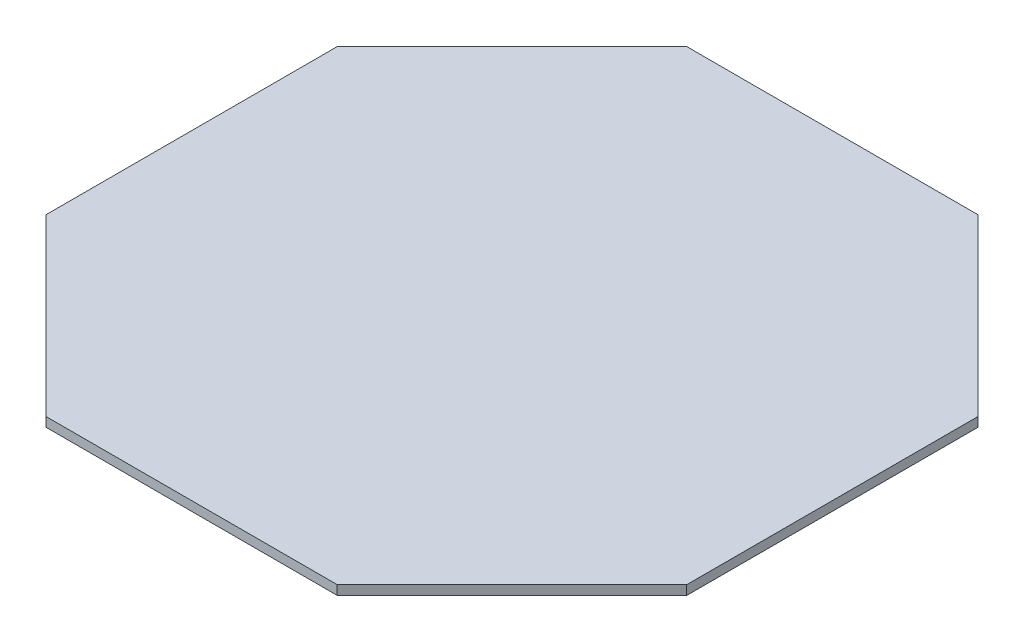
ISO-10303-21;
HEADER;
FILE_DESCRIPTION(('STEP AP214'),'2;1');
FILE_NAME('part.step','',(''),(''),'','','');
FILE_SCHEMA(('AUTOMOTIVE_DESIGN { 1 0 10303 214 1 1 1 1 }'));
ENDSEC;
DATA;
#1=APPLICATION_CONTEXT('core data for automotive mechanical design processes');
#2=APPLICATION_PROTOCOL_DEFINITION('international standard','automotive_design',2000,#1);
#3=PRODUCT_CONTEXT('',#1,'mechanical');
#4=PRODUCT('Part','Part','',(#3));
#5=PRODUCT_RELATED_PRODUCT_CATEGORY('part','',(#4));
#6=PRODUCT_DEFINITION_FORMATION('','',#4);
#7=PRODUCT_DEFINITION_CONTEXT('part definition',#1,'design');
#8=PRODUCT_DEFINITION('design','',#6,#7);
#9=PRODUCT_DEFINITION_SHAPE('','',#8);
#10=(LENGTH_UNIT() NAMED_UNIT(*) SI_UNIT(.MILLI.,.METRE.));
#11=(NAMED_UNIT(*) PLANE_ANGLE_UNIT() SI_UNIT($,.RADIAN.));
#12=(NAMED_UNIT(*) SI_UNIT($,.STERADIAN.) SOLID_ANGLE_UNIT());
#13=UNCERTAINTY_MEASURE_WITH_UNIT(LENGTH_MEASURE(1.E-05),#10,'distance_accuracy_value','');
#14=(GEOMETRIC_REPRESENTATION_CONTEXT(3) GLOBAL_UNCERTAINTY_ASSIGNED_CONTEXT((#13)) GLOBAL_UNIT_ASSIGNED_CONTEXT((#10,
#11,#12)) REPRESENTATION_CONTEXT('',''));
#15=CARTESIAN_POINT('',(0.,0.,0.));
#16=DIRECTION('',(0.,0.,1.));
#17=DIRECTION('',(1.,0.,0.));
#18=AXIS2_PLACEMENT_3D('',#15,#16,#17);
#19=CARTESIAN_POINT('',(-25.,0.8,-55.));
#20=DIRECTION('',(0.707106781186547,0.,0.707106781186548));
#21=DIRECTION('',(0.707106781186548,0.,-0.707106781186547));
#22=AXIS2_PLACEMENT_3D('',#19,#20,#21);
#23=PLANE('',#22);
#24=DIRECTION('',(-0.707106781186548,0.,0.707106781186547));
#25=VECTOR('',#24,1.);
#26=CARTESIAN_POINT('',(-25.,-0.8,-55.));
#27=LINE('',#26,#25);
#28=CARTESIAN_POINT('',(-25.,-0.8,-55.));
#29=VERTEX_POINT('',#28);
#30=CARTESIAN_POINT('',(-55.,-0.8,-25.));
#31=VERTEX_POINT('',#30);
#32=EDGE_CURVE('E131',#29,#31,#27,.T.);
#33=ORIENTED_EDGE('',*,*,#32,.T.);
#34=DIRECTION('',(0.,-1.,0.));
#35=VECTOR('',#34,1.);
#36=CARTESIAN_POINT('',(-55.,0.8,-25.));
#37=LINE('',#36,#35);
#38=CARTESIAN_POINT('',(-55.,0.8,-25.));
#39=VERTEX_POINT('',#38);
#40=EDGE_CURVE('E11',#39,#31,#37,.T.);
#41=ORIENTED_EDGE('',*,*,#40,.F.);
#42=DIRECTION('',(-0.707106781186548,0.,0.707106781186547));
#43=VECTOR('',#42,1.);
#44=CARTESIAN_POINT('',(-25.,0.8,-55.));
#45=LINE('',#44,#43);
#46=CARTESIAN_POINT('',(-25.,0.8,-55.));
#47=VERTEX_POINT('',#46);
#48=EDGE_CURVE('E145',#47,#39,#45,.T.);
#49=ORIENTED_EDGE('',*,*,#48,.F.);
#50=DIRECTION('',(0.,-1.,0.));
#51=VECTOR('',#50,1.);
#52=CARTESIAN_POINT('',(-25.,0.8,-55.));
#53=LINE('',#52,#51);
#54=EDGE_CURVE('E127',#47,#29,#53,.T.);
#55=ORIENTED_EDGE('',*,*,#54,.T.);
#56=EDGE_LOOP('',(#33,#41,#49,#55));
#57=FACE_BOUND('',#56,.T.);
#58=ADVANCED_FACE('F35',(#57),#23,.F.);
#59=CARTESIAN_POINT('',(-55.,0.8,-25.));
#60=DIRECTION('',(1.,0.,0.));
#61=DIRECTION('',(0.,0.,-1.));
#62=AXIS2_PLACEMENT_3D('',#59,#60,#61);
#63=PLANE('',#62);
#64=DIRECTION('',(0.,0.,1.));
#65=VECTOR('',#64,1.);
#66=CARTESIAN_POINT('',(-55.,-0.8,-25.));
#67=LINE('',#66,#65);
#68=CARTESIAN_POINT('',(-55.,-0.8,25.));
#69=VERTEX_POINT('',#68);
#70=EDGE_CURVE('E134',#31,#69,#67,.T.);
#71=ORIENTED_EDGE('',*,*,#70,.T.);
#72=DIRECTION('',(0.,-1.,0.));
#73=VECTOR('',#72,1.);
#74=CARTESIAN_POINT('',(-55.,0.8,25.));
#75=LINE('',#74,#73);
#76=CARTESIAN_POINT('',(-55.,0.8,25.));
#77=VERTEX_POINT('',#76);
#78=EDGE_CURVE('E43',#77,#69,#75,.T.);
#79=ORIENTED_EDGE('',*,*,#78,.F.);
#80=DIRECTION('',(0.,0.,1.));
#81=VECTOR('',#80,1.);
#82=CARTESIAN_POINT('',(-55.,0.8,-25.));
#83=LINE('',#82,#81);
#84=EDGE_CURVE('E94',#39,#77,#83,.T.);
#85=ORIENTED_EDGE('',*,*,#84,.F.);
#86=ORIENTED_EDGE('',*,*,#40,.T.);
#87=EDGE_LOOP('',(#71,#79,#85,#86));
#88=FACE_BOUND('',#87,.T.);
#89=ADVANCED_FACE('F180',(#88),#63,.F.);
#90=CARTESIAN_POINT('',(-55.,0.8,25.));
#91=DIRECTION('',(0.707106781186547,0.,-0.707106781186548));
#92=DIRECTION('',(-0.707106781186548,0.,-0.707106781186547));
#93=AXIS2_PLACEMENT_3D('',#90,#91,#92);
#94=PLANE('',#93);
#95=DIRECTION('',(0.707106781186548,0.,0.707106781186547));
#96=VECTOR('',#95,1.);
#97=CARTESIAN_POINT('',(-55.,-0.8,25.));
#98=LINE('',#97,#96);
#99=CARTESIAN_POINT('',(-25.,-0.8,55.));
#100=VERTEX_POINT('',#99);
#101=EDGE_CURVE('E136',#69,#100,#98,.T.);
#102=ORIENTED_EDGE('',*,*,#101,.T.);
#103=DIRECTION('',(0.,-1.,0.));
#104=VECTOR('',#103,1.);
#105=CARTESIAN_POINT('',(-25.,0.8,55.));
#106=LINE('',#105,#104);
#107=CARTESIAN_POINT('',(-25.,0.8,55.));
#108=VERTEX_POINT('',#107);
#109=EDGE_CURVE('E152',#108,#100,#106,.T.);
#110=ORIENTED_EDGE('',*,*,#109,.F.);
#111=DIRECTION('',(0.707106781186548,0.,0.707106781186547));
#112=VECTOR('',#111,1.);
#113=CARTESIAN_POINT('',(-55.,0.8,25.));
#114=LINE('',#113,#112);
#115=EDGE_CURVE('E160',#77,#108,#114,.T.);
#116=ORIENTED_EDGE('',*,*,#115,.F.);
#117=ORIENTED_EDGE('',*,*,#78,.T.);
#118=EDGE_LOOP('',(#102,#110,#116,#117));
#119=FACE_BOUND('',#118,.T.);
#120=ADVANCED_FACE('F158',(#119),#94,.F.);
#121=CARTESIAN_POINT('',(-25.,0.8,55.));
#122=DIRECTION('',(0.,0.,-1.));
#123=DIRECTION('',(-1.,0.,0.));
#124=AXIS2_PLACEMENT_3D('',#121,#122,#123);
#125=PLANE('',#124);
#126=DIRECTION('',(1.,0.,0.));
#127=VECTOR('',#126,1.);
#128=CARTESIAN_POINT('',(-25.,-0.8,55.));
#129=LINE('',#128,#127);
#130=CARTESIAN_POINT('',(25.,-0.8,55.));
#131=VERTEX_POINT('',#130);
#132=EDGE_CURVE('E138',#100,#131,#129,.T.);
#133=ORIENTED_EDGE('',*,*,#132,.T.);
#134=DIRECTION('',(0.,-1.,0.));
#135=VECTOR('',#134,1.);
#136=CARTESIAN_POINT('',(25.,0.8,55.));
#137=LINE('',#136,#135);
#138=CARTESIAN_POINT('',(25.,0.8,55.));
#139=VERTEX_POINT('',#138);
#140=EDGE_CURVE('E149',#139,#131,#137,.T.);
#141=ORIENTED_EDGE('',*,*,#140,.F.);
#142=DIRECTION('',(1.,0.,0.));
#143=VECTOR('',#142,1.);
#144=CARTESIAN_POINT('',(-25.,0.8,55.));
#145=LINE('',#144,#143);
#146=EDGE_CURVE('E172',#108,#139,#145,.T.);
#147=ORIENTED_EDGE('',*,*,#146,.F.);
#148=ORIENTED_EDGE('',*,*,#109,.T.);
#149=EDGE_LOOP('',(#133,#141,#147,#148));
#150=FACE_BOUND('',#149,.T.);
#151=ADVANCED_FACE('F168',(#150),#125,.F.);
#152=CARTESIAN_POINT('',(25.,0.8,55.));
#153=DIRECTION('',(-0.707106781186547,0.,-0.707106781186548));
#154=DIRECTION('',(-0.707106781186548,0.,0.707106781186547));
#155=AXIS2_PLACEMENT_3D('',#152,#153,#154);
#156=PLANE('',#155);
#157=DIRECTION('',(0.707106781186548,0.,-0.707106781186547));
#158=VECTOR('',#157,1.);
#159=CARTESIAN_POINT('',(25.,-0.8,55.));
#160=LINE('',#159,#158);
#161=CARTESIAN_POINT('',(55.,-0.8,25.));
#162=VERTEX_POINT('',#161);
#163=EDGE_CURVE('E140',#131,#162,#160,.T.);
#164=ORIENTED_EDGE('',*,*,#163,.T.);
#165=DIRECTION('',(0.,-1.,0.));
#166=VECTOR('',#165,1.);
#167=CARTESIAN_POINT('',(55.,0.8,25.));
#168=LINE('',#167,#166);
#169=CARTESIAN_POINT('',(55.,0.8,25.));
#170=VERTEX_POINT('',#169);
#171=EDGE_CURVE('E122',#170,#162,#168,.T.);
#172=ORIENTED_EDGE('',*,*,#171,.F.);
#173=DIRECTION('',(0.707106781186548,0.,-0.707106781186547));
#174=VECTOR('',#173,1.);
#175=CARTESIAN_POINT('',(25.,0.8,55.));
#176=LINE('',#175,#174);
#177=EDGE_CURVE('E113',#139,#170,#176,.T.);
#178=ORIENTED_EDGE('',*,*,#177,.F.);
#179=ORIENTED_EDGE('',*,*,#140,.T.);
#180=EDGE_LOOP('',(#164,#172,#178,#179));
#181=FACE_BOUND('',#180,.T.);
#182=ADVANCED_FACE('F171',(#181),#156,.F.);
#183=CARTESIAN_POINT('',(55.,0.8,25.));
#184=DIRECTION('',(-1.,0.,0.));
#185=DIRECTION('',(0.,0.,1.));
#186=AXIS2_PLACEMENT_3D('',#183,#184,#185);
#187=PLANE('',#186);
#188=DIRECTION('',(0.,0.,-1.));
#189=VECTOR('',#188,1.);
#190=CARTESIAN_POINT('',(55.,-0.8,25.));
#191=LINE('',#190,#189);
#192=CARTESIAN_POINT('',(55.,-0.8,-25.));
#193=VERTEX_POINT('',#192);
#194=EDGE_CURVE('E121',#162,#193,#191,.T.);
#195=ORIENTED_EDGE('',*,*,#194,.T.);
#196=DIRECTION('',(0.,-1.,0.));
#197=VECTOR('',#196,1.);
#198=CARTESIAN_POINT('',(55.,0.8,-25.));
#199=LINE('',#198,#197);
#200=CARTESIAN_POINT('',(55.,0.8,-25.));
#201=VERTEX_POINT('',#200);
#202=EDGE_CURVE('E118',#201,#193,#199,.T.);
#203=ORIENTED_EDGE('',*,*,#202,.F.);
#204=DIRECTION('',(0.,0.,-1.));
#205=VECTOR('',#204,1.);
#206=CARTESIAN_POINT('',(55.,0.8,25.));
#207=LINE('',#206,#205);
#208=EDGE_CURVE('E107',#170,#201,#207,.T.);
#209=ORIENTED_EDGE('',*,*,#208,.F.);
#210=ORIENTED_EDGE('',*,*,#171,.T.);
#211=EDGE_LOOP('',(#195,#203,#209,#210));
#212=FACE_BOUND('',#211,.T.);
#213=ADVANCED_FACE('F119',(#212),#187,.F.);
#214=CARTESIAN_POINT('',(55.,0.8,-25.));
#215=DIRECTION('',(-0.707106781186547,0.,0.707106781186548));
#216=DIRECTION('',(0.707106781186548,0.,0.707106781186547));
#217=AXIS2_PLACEMENT_3D('',#214,#215,#216);
#218=PLANE('',#217);
#219=DIRECTION('',(-0.707106781186548,0.,-0.707106781186547));
#220=VECTOR('',#219,1.);
#221=CARTESIAN_POINT('',(55.,-0.8,-25.));
#222=LINE('',#221,#220);
#223=CARTESIAN_POINT('',(25.,-0.8,-55.));
#224=VERTEX_POINT('',#223);
#225=EDGE_CURVE('E80',#193,#224,#222,.T.);
#226=ORIENTED_EDGE('',*,*,#225,.T.);
#227=DIRECTION('',(0.,-1.,0.));
#228=VECTOR('',#227,1.);
#229=CARTESIAN_POINT('',(25.,0.8,-55.));
#230=LINE('',#229,#228);
#231=CARTESIAN_POINT('',(25.,0.8,-55.));
#232=VERTEX_POINT('',#231);
#233=EDGE_CURVE('E123',#232,#224,#230,.T.);
#234=ORIENTED_EDGE('',*,*,#233,.F.);
#235=DIRECTION('',(-0.707106781186548,0.,-0.707106781186547));
#236=VECTOR('',#235,1.);
#237=CARTESIAN_POINT('',(55.,0.8,-25.));
#238=LINE('',#237,#236);
#239=EDGE_CURVE('E111',#201,#232,#238,.T.);
#240=ORIENTED_EDGE('',*,*,#239,.F.);
#241=ORIENTED_EDGE('',*,*,#202,.T.);
#242=EDGE_LOOP('',(#226,#234,#240,#241));
#243=FACE_BOUND('',#242,.T.);
#244=ADVANCED_FACE('F125',(#243),#218,.F.);
#245=CARTESIAN_POINT('',(25.,0.8,-55.));
#246=DIRECTION('',(0.,0.,1.));
#247=DIRECTION('',(1.,0.,0.));
#248=AXIS2_PLACEMENT_3D('',#245,#246,#247);
#249=PLANE('',#248);
#250=DIRECTION('',(-1.,0.,0.));
#251=VECTOR('',#250,1.);
#252=CARTESIAN_POINT('',(25.,-0.8,-55.));
#253=LINE('',#252,#251);
#254=EDGE_CURVE('E86',#224,#29,#253,.T.);
#255=ORIENTED_EDGE('',*,*,#254,.T.);
#256=ORIENTED_EDGE('',*,*,#54,.F.);
#257=DIRECTION('',(-1.,0.,0.));
#258=VECTOR('',#257,1.);
#259=CARTESIAN_POINT('',(25.,0.8,-55.));
#260=LINE('',#259,#258);
#261=EDGE_CURVE('E51',#232,#47,#260,.T.);
#262=ORIENTED_EDGE('',*,*,#261,.F.);
#263=ORIENTED_EDGE('',*,*,#233,.T.);
#264=EDGE_LOOP('',(#255,#256,#262,#263));
#265=FACE_BOUND('',#264,.T.);
#266=ADVANCED_FACE('F196',(#265),#249,.F.);
#267=CARTESIAN_POINT('',(0.,0.8,0.));
#268=DIRECTION('',(0.,1.,0.));
#269=DIRECTION('',(0.,0.,1.));
#270=AXIS2_PLACEMENT_3D('',#267,#268,#269);
#271=PLANE('',#270);
#272=ORIENTED_EDGE('',*,*,#48,.T.);
#273=ORIENTED_EDGE('',*,*,#84,.T.);
#274=ORIENTED_EDGE('',*,*,#115,.T.);
#275=ORIENTED_EDGE('',*,*,#146,.T.);
#276=ORIENTED_EDGE('',*,*,#177,.T.);
#277=ORIENTED_EDGE('',*,*,#208,.T.);
#278=ORIENTED_EDGE('',*,*,#239,.T.);
#279=ORIENTED_EDGE('',*,*,#261,.T.);
#280=EDGE_LOOP('',(#272,#273,#274,#275,#276,#277,#278,#279));
#281=FACE_BOUND('',#280,.T.);
#282=ADVANCED_FACE('F109',(#281),#271,.T.);
#283=CARTESIAN_POINT('',(0.,-0.8,0.));
#284=DIRECTION('',(0.,1.,0.));
#285=DIRECTION('',(0.,0.,1.));
#286=AXIS2_PLACEMENT_3D('',#283,#284,#285);
#287=PLANE('',#286);
#288=ORIENTED_EDGE('',*,*,#32,.F.);
#289=ORIENTED_EDGE('',*,*,#254,.F.);
#290=ORIENTED_EDGE('',*,*,#225,.F.);
#291=ORIENTED_EDGE('',*,*,#194,.F.);
#292=ORIENTED_EDGE('',*,*,#163,.F.);
#293=ORIENTED_EDGE('',*,*,#132,.F.);
#294=ORIENTED_EDGE('',*,*,#101,.F.);
#295=ORIENTED_EDGE('',*,*,#70,.F.);
#296=EDGE_LOOP('',(#288,#289,#290,#291,#292,#293,#294,#295));
#297=FACE_BOUND('',#296,.T.);
#298=ADVANCED_FACE('F164',(#297),#287,.F.);
#299=CLOSED_SHELL('',(#58,#89,#120,#151,#182,#213,#244,#266,#282,#298));
#300=MANIFOLD_SOLID_BREP('B2',#299);
#301=ADVANCED_BREP_SHAPE_REPRESENTATION('',(#18,#300),#14);
#302=SHAPE_DEFINITION_REPRESENTATION(#9,#301);
ENDSEC;
END-ISO-10303-21;
